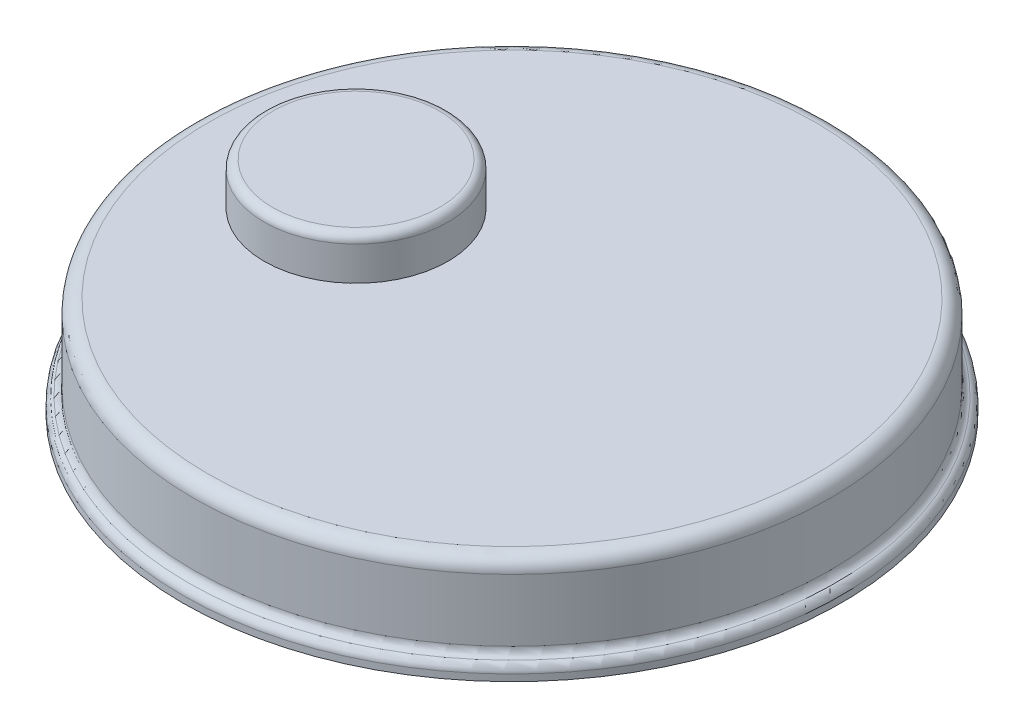
ISO-10303-21;
HEADER;
FILE_DESCRIPTION(('STEP AP214'),'2;1');
FILE_NAME('part.step','',(''),(''),'','','');
FILE_SCHEMA(('AUTOMOTIVE_DESIGN { 1 0 10303 214 1 1 1 1 }'));
ENDSEC;
DATA;
#1=APPLICATION_CONTEXT('core data for automotive mechanical design processes');
#2=APPLICATION_PROTOCOL_DEFINITION('international standard','automotive_design',2000,#1);
#3=PRODUCT_CONTEXT('',#1,'mechanical');
#4=PRODUCT('Part','Part','',(#3));
#5=PRODUCT_RELATED_PRODUCT_CATEGORY('part','',(#4));
#6=PRODUCT_DEFINITION_FORMATION('','',#4);
#7=PRODUCT_DEFINITION_CONTEXT('part definition',#1,'design');
#8=PRODUCT_DEFINITION('design','',#6,#7);
#9=PRODUCT_DEFINITION_SHAPE('','',#8);
#10=(LENGTH_UNIT() NAMED_UNIT(*) SI_UNIT(.MILLI.,.METRE.));
#11=(NAMED_UNIT(*) PLANE_ANGLE_UNIT() SI_UNIT($,.RADIAN.));
#12=(NAMED_UNIT(*) SI_UNIT($,.STERADIAN.) SOLID_ANGLE_UNIT());
#13=UNCERTAINTY_MEASURE_WITH_UNIT(LENGTH_MEASURE(1.E-05),#10,'distance_accuracy_value','');
#14=(GEOMETRIC_REPRESENTATION_CONTEXT(3) GLOBAL_UNCERTAINTY_ASSIGNED_CONTEXT((#13)) GLOBAL_UNIT_ASSIGNED_CONTEXT((#10,
#11,#12)) REPRESENTATION_CONTEXT('',''));
#15=CARTESIAN_POINT('',(0.,0.,0.));
#16=DIRECTION('',(0.,0.,1.));
#17=DIRECTION('',(1.,0.,0.));
#18=AXIS2_PLACEMENT_3D('',#15,#16,#17);
#19=CARTESIAN_POINT('',(-20.4910714285714,41.4397321428572,0.));
#20=DIRECTION('',(0.,1.,0.));
#21=DIRECTION('',(0.,0.,1.));
#22=AXIS2_PLACEMENT_3D('',#19,#20,#21);
#23=PLANE('',#22);
#24=CARTESIAN_POINT('',(-75.6080104174389,41.4397321428572,0.));
#25=DIRECTION('',(0.,1.,0.));
#26=DIRECTION('',(0.,0.,1.));
#27=AXIS2_PLACEMENT_3D('',#24,#25,#26);
#28=CIRCLE('',#27,32.5);
#29=CARTESIAN_POINT('',(-75.6080104174389,41.4397321428572,32.5));
#30=VERTEX_POINT('',#29);
#31=EDGE_CURVE('E63',#30,#30,#28,.T.);
#32=ORIENTED_EDGE('',*,*,#31,.F.);
#33=EDGE_LOOP('',(#32));
#34=FACE_BOUND('',#33,.T.);
#35=CARTESIAN_POINT('',(-20.4910714285714,41.4397321428572,0.));
#36=DIRECTION('',(0.,1.,0.));
#37=DIRECTION('',(0.,0.,1.));
#38=AXIS2_PLACEMENT_3D('',#35,#36,#37);
#39=CIRCLE('',#38,107.5);
#40=CARTESIAN_POINT('',(-20.4910714285714,41.4397321428572,107.5));
#41=VERTEX_POINT('',#40);
#42=EDGE_CURVE('E42',#41,#41,#39,.T.);
#43=ORIENTED_EDGE('',*,*,#42,.T.);
#44=EDGE_LOOP('',(#43));
#45=FACE_BOUND('',#44,.T.);
#46=ADVANCED_FACE('F31',(#34,#45),#23,.T.);
#47=CARTESIAN_POINT('',(-20.4910714285714,6.43973214285714,0.));
#48=DIRECTION('',(0.,-1.,0.));
#49=DIRECTION('',(0.,0.,-1.));
#50=AXIS2_PLACEMENT_3D('',#47,#48,#49);
#51=CYLINDRICAL_SURFACE('',#50,112.5);
#52=CARTESIAN_POINT('',(-20.4910714285714,36.4397321428572,0.));
#53=DIRECTION('',(0.,1.,0.));
#54=DIRECTION('',(0.,0.,1.));
#55=AXIS2_PLACEMENT_3D('',#52,#53,#54);
#56=CIRCLE('',#55,112.5);
#57=CARTESIAN_POINT('',(-20.4910714285714,36.4397321428572,112.5));
#58=VERTEX_POINT('',#57);
#59=EDGE_CURVE('E46',#58,#58,#56,.F.);
#60=ORIENTED_EDGE('',*,*,#59,.T.);
#61=EDGE_LOOP('',(#60));
#62=FACE_BOUND('',#61,.T.);
#63=CARTESIAN_POINT('',(-20.4910714285714,14.4397321428572,0.));
#64=DIRECTION('',(0.,1.,0.));
#65=DIRECTION('',(0.,0.,1.));
#66=AXIS2_PLACEMENT_3D('',#63,#64,#65);
#67=CIRCLE('',#66,112.5);
#68=CARTESIAN_POINT('',(-20.4910714285714,14.4397321428572,112.5));
#69=VERTEX_POINT('',#68);
#70=EDGE_CURVE('E57',#69,#69,#67,.T.);
#71=ORIENTED_EDGE('',*,*,#70,.T.);
#72=EDGE_LOOP('',(#71));
#73=FACE_BOUND('',#72,.T.);
#74=ADVANCED_FACE('F71',(#62,#73),#51,.T.);
#75=CARTESIAN_POINT('',(-20.4910714285714,6.43973214285714,0.));
#76=DIRECTION('',(0.,-1.,0.));
#77=DIRECTION('',(0.,0.,-1.));
#78=AXIS2_PLACEMENT_3D('',#75,#76,#77);
#79=CYLINDRICAL_SURFACE('',#78,116.5);
#80=CARTESIAN_POINT('',(-20.4910714285714,8.78287789336478,0.));
#81=DIRECTION('',(0.,1.,0.));
#82=DIRECTION('',(0.,0.,1.));
#83=AXIS2_PLACEMENT_3D('',#80,#81,#82);
#84=CIRCLE('',#83,116.5);
#85=CARTESIAN_POINT('',(-20.4910714285714,8.78287789336478,116.5));
#86=VERTEX_POINT('',#85);
#87=EDGE_CURVE('E54',#86,#86,#84,.F.);
#88=ORIENTED_EDGE('',*,*,#87,.T.);
#89=EDGE_LOOP('',(#88));
#90=FACE_BOUND('',#89,.T.);
#91=CARTESIAN_POINT('',(-20.4910714285714,6.43973214285715,0.));
#92=DIRECTION('',(0.,-1.,0.));
#93=DIRECTION('',(0.,0.,-1.));
#94=AXIS2_PLACEMENT_3D('',#91,#92,#93);
#95=CIRCLE('',#94,116.5);
#96=CARTESIAN_POINT('',(-20.4910714285714,6.43973214285715,-116.5));
#97=VERTEX_POINT('',#96);
#98=EDGE_CURVE('E60',#97,#97,#95,.T.);
#99=ORIENTED_EDGE('',*,*,#98,.F.);
#100=EDGE_LOOP('',(#99));
#101=FACE_BOUND('',#100,.T.);
#102=ADVANCED_FACE('F83',(#90,#101),#79,.T.);
#103=CARTESIAN_POINT('',(96.0089285714286,6.43973214285715,0.));
#104=DIRECTION('',(0.,-1.,0.));
#105=DIRECTION('',(0.,0.,-1.));
#106=AXIS2_PLACEMENT_3D('',#103,#104,#105);
#107=PLANE('',#106);
#108=ORIENTED_EDGE('',*,*,#98,.T.);
#109=EDGE_LOOP('',(#108));
#110=FACE_BOUND('',#109,.T.);
#111=ADVANCED_FACE('F89',(#110),#107,.T.);
#112=CARTESIAN_POINT('',(-20.4910714285714,14.4397321428572,0.));
#113=DIRECTION('',(0.,1.,0.));
#114=DIRECTION('',(0.,0.,1.));
#115=AXIS2_PLACEMENT_3D('',#112,#113,#114);
#116=TOROIDAL_SURFACE('',#115,115.5,3.);
#117=CARTESIAN_POINT('',(-20.4910714285714,11.6113050181217,0.));
#118=DIRECTION('',(0.,1.,0.));
#119=DIRECTION('',(0.,0.,1.));
#120=AXIS2_PLACEMENT_3D('',#117,#118,#119);
#121=CIRCLE('',#120,114.500000000004);
#122=CARTESIAN_POINT('',(-20.4910714285714,11.6113050181217,114.500000000004));
#123=VERTEX_POINT('',#122);
#124=EDGE_CURVE('E51',#123,#123,#121,.T.);
#125=ORIENTED_EDGE('',*,*,#124,.T.);
#126=EDGE_LOOP('',(#125));
#127=FACE_BOUND('',#126,.T.);
#128=ORIENTED_EDGE('',*,*,#70,.F.);
#129=EDGE_LOOP('',(#128));
#130=FACE_BOUND('',#129,.T.);
#131=ADVANCED_FACE('F87',(#127,#130),#116,.F.);
#132=CARTESIAN_POINT('',(-20.4910714285714,8.78287789336478,0.));
#133=DIRECTION('',(0.,1.,0.));
#134=DIRECTION('',(0.,0.,1.));
#135=AXIS2_PLACEMENT_3D('',#132,#133,#134);
#136=TOROIDAL_SURFACE('',#135,113.5,3.);
#137=ORIENTED_EDGE('',*,*,#124,.F.);
#138=EDGE_LOOP('',(#137));
#139=FACE_BOUND('',#138,.T.);
#140=ORIENTED_EDGE('',*,*,#87,.F.);
#141=EDGE_LOOP('',(#140));
#142=FACE_BOUND('',#141,.T.);
#143=ADVANCED_FACE('F78',(#139,#142),#136,.T.);
#144=CARTESIAN_POINT('',(-20.4910714285714,36.4397321428572,0.));
#145=DIRECTION('',(0.,1.,0.));
#146=DIRECTION('',(0.,0.,1.));
#147=AXIS2_PLACEMENT_3D('',#144,#145,#146);
#148=TOROIDAL_SURFACE('',#147,107.5,5.);
#149=ORIENTED_EDGE('',*,*,#42,.F.);
#150=EDGE_LOOP('',(#149));
#151=FACE_BOUND('',#150,.T.);
#152=ORIENTED_EDGE('',*,*,#59,.F.);
#153=EDGE_LOOP('',(#152));
#154=FACE_BOUND('',#153,.T.);
#155=ADVANCED_FACE('F75',(#151,#154),#148,.T.);
#156=CARTESIAN_POINT('',(-75.6080104174389,56.4397321428571,0.));
#157=DIRECTION('',(0.,-1.,0.));
#158=DIRECTION('',(0.,0.,-1.));
#159=AXIS2_PLACEMENT_3D('',#156,#157,#158);
#160=CYLINDRICAL_SURFACE('',#159,32.5);
#161=CARTESIAN_POINT('',(-75.6080104174389,53.4397321428571,0.));
#162=DIRECTION('',(0.,1.,0.));
#163=DIRECTION('',(0.,0.,1.));
#164=AXIS2_PLACEMENT_3D('',#161,#162,#163);
#165=CIRCLE('',#164,32.5);
#166=CARTESIAN_POINT('',(-75.6080104174389,53.4397321428571,32.5));
#167=VERTEX_POINT('',#166);
#168=EDGE_CURVE('E10',#167,#167,#165,.F.);
#169=ORIENTED_EDGE('',*,*,#168,.T.);
#170=EDGE_LOOP('',(#169));
#171=FACE_BOUND('',#170,.T.);
#172=ORIENTED_EDGE('',*,*,#31,.T.);
#173=EDGE_LOOP('',(#172));
#174=FACE_BOUND('',#173,.T.);
#175=ADVANCED_FACE('F67',(#171,#174),#160,.T.);
#176=CARTESIAN_POINT('',(-75.6080104174389,56.4397321428571,0.));
#177=DIRECTION('',(0.,1.,0.));
#178=DIRECTION('',(0.,0.,1.));
#179=AXIS2_PLACEMENT_3D('',#176,#177,#178);
#180=PLANE('',#179);
#181=CARTESIAN_POINT('',(-75.6080104174389,56.4397321428571,0.));
#182=DIRECTION('',(0.,1.,0.));
#183=DIRECTION('',(0.,0.,1.));
#184=AXIS2_PLACEMENT_3D('',#181,#182,#183);
#185=CIRCLE('',#184,29.5);
#186=CARTESIAN_POINT('',(-75.6080104174389,56.4397321428571,29.5));
#187=VERTEX_POINT('',#186);
#188=EDGE_CURVE('E38',#187,#187,#185,.T.);
#189=ORIENTED_EDGE('',*,*,#188,.T.);
#190=EDGE_LOOP('',(#189));
#191=FACE_BOUND('',#190,.T.);
#192=ADVANCED_FACE('F106',(#191),#180,.T.);
#193=CARTESIAN_POINT('',(-75.6080104174389,53.4397321428571,0.));
#194=DIRECTION('',(0.,1.,0.));
#195=DIRECTION('',(0.,0.,1.));
#196=AXIS2_PLACEMENT_3D('',#193,#194,#195);
#197=TOROIDAL_SURFACE('',#196,29.5,3.);
#198=ORIENTED_EDGE('',*,*,#168,.F.);
#199=EDGE_LOOP('',(#198));
#200=FACE_BOUND('',#199,.T.);
#201=ORIENTED_EDGE('',*,*,#188,.F.);
#202=EDGE_LOOP('',(#201));
#203=FACE_BOUND('',#202,.T.);
#204=ADVANCED_FACE('F33',(#200,#203),#197,.T.);
#205=CLOSED_SHELL('',(#46,#74,#102,#111,#131,#143,#155,#175,#192,#204));
#206=MANIFOLD_SOLID_BREP('B2',#205);
#207=ADVANCED_BREP_SHAPE_REPRESENTATION('',(#18,#206),#14);
#208=SHAPE_DEFINITION_REPRESENTATION(#9,#207);
ENDSEC;
END-ISO-10303-21;
